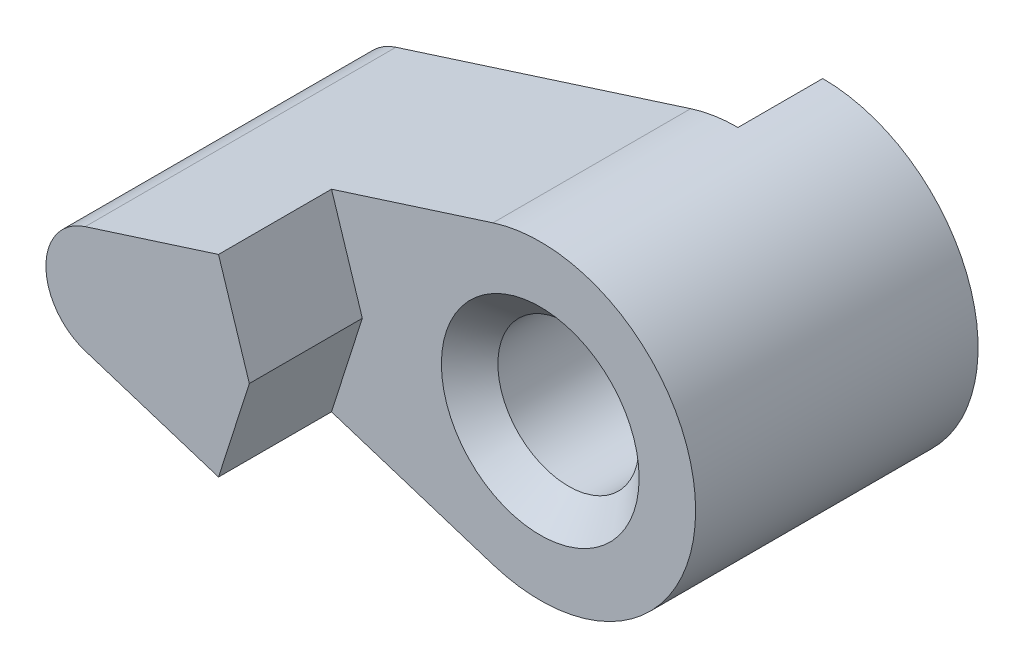
ISO-10303-21;
HEADER;
FILE_DESCRIPTION(('STEP AP214'),'2;1');
FILE_NAME('part.step','',(''),(''),'','','');
FILE_SCHEMA(('AUTOMOTIVE_DESIGN { 1 0 10303 214 1 1 1 1 }'));
ENDSEC;
DATA;
#1=APPLICATION_CONTEXT('core data for automotive mechanical design processes');
#2=APPLICATION_PROTOCOL_DEFINITION('international standard','automotive_design',2000,#1);
#3=PRODUCT_CONTEXT('',#1,'mechanical');
#4=PRODUCT('Part','Part','',(#3));
#5=PRODUCT_RELATED_PRODUCT_CATEGORY('part','',(#4));
#6=PRODUCT_DEFINITION_FORMATION('','',#4);
#7=PRODUCT_DEFINITION_CONTEXT('part definition',#1,'design');
#8=PRODUCT_DEFINITION('design','',#6,#7);
#9=PRODUCT_DEFINITION_SHAPE('','',#8);
#10=(LENGTH_UNIT() NAMED_UNIT(*) SI_UNIT(.MILLI.,.METRE.));
#11=(NAMED_UNIT(*) PLANE_ANGLE_UNIT() SI_UNIT($,.RADIAN.));
#12=(NAMED_UNIT(*) SI_UNIT($,.STERADIAN.) SOLID_ANGLE_UNIT());
#13=UNCERTAINTY_MEASURE_WITH_UNIT(LENGTH_MEASURE(1.E-05),#10,'distance_accuracy_value','');
#14=(GEOMETRIC_REPRESENTATION_CONTEXT(3) GLOBAL_UNCERTAINTY_ASSIGNED_CONTEXT((#13)) GLOBAL_UNIT_ASSIGNED_CONTEXT((#10,
#11,#12)) REPRESENTATION_CONTEXT('',''));
#15=CARTESIAN_POINT('',(0.,0.,0.));
#16=DIRECTION('',(0.,0.,1.));
#17=DIRECTION('',(1.,0.,0.));
#18=AXIS2_PLACEMENT_3D('',#15,#16,#17);
#19=CARTESIAN_POINT('',(-1.67391304347826,5.23908533265811,14.));
#20=DIRECTION('',(0.304347826086956,-0.952560969574202,0.));
#21=DIRECTION('',(0.952560969574202,0.304347826086957,0.));
#22=AXIS2_PLACEMENT_3D('',#19,#20,#21);
#23=PLANE('',#22);
#24=DIRECTION('',(-0.952560969574202,-0.304347826086957,0.));
#25=VECTOR('',#24,1.);
#26=CARTESIAN_POINT('',(-20.9265529123236,-0.912226003494337,3.));
#27=LINE('',#26,#25);
#28=CARTESIAN_POINT('',(-1.67391304347826,5.23908533265811,3.));
#29=VERTEX_POINT('',#28);
#30=CARTESIAN_POINT('',(-12.1086956521739,1.9051219391484,3.));
#31=VERTEX_POINT('',#30);
#32=EDGE_CURVE('E130',#29,#31,#27,.T.);
#33=ORIENTED_EDGE('',*,*,#32,.T.);
#34=DIRECTION('',(0.,0.,-1.));
#35=VECTOR('',#34,1.);
#36=CARTESIAN_POINT('',(-12.1086956521739,1.9051219391484,14.));
#37=LINE('',#36,#35);
#38=CARTESIAN_POINT('',(-12.1086956521739,1.9051219391484,14.));
#39=VERTEX_POINT('',#38);
#40=EDGE_CURVE('E198',#39,#31,#37,.T.);
#41=ORIENTED_EDGE('',*,*,#40,.F.);
#42=DIRECTION('',(-0.952560969574202,-0.304347826086957,0.));
#43=VECTOR('',#42,1.);
#44=CARTESIAN_POINT('',(-1.67391304347826,5.23908533265811,14.));
#45=LINE('',#44,#43);
#46=CARTESIAN_POINT('',(-7.38927886092347,3.41299837613637,14.));
#47=VERTEX_POINT('',#46);
#48=EDGE_CURVE('E184',#47,#39,#45,.T.);
#49=ORIENTED_EDGE('',*,*,#48,.F.);
#50=DIRECTION('',(0.,0.,1.));
#51=VECTOR('',#50,1.);
#52=CARTESIAN_POINT('',(-7.38927886092347,3.41299837613637,10.));
#53=LINE('',#52,#51);
#54=CARTESIAN_POINT('',(-7.38927886092347,3.41299837613637,10.));
#55=VERTEX_POINT('',#54);
#56=EDGE_CURVE('E169',#55,#47,#53,.T.);
#57=ORIENTED_EDGE('',*,*,#56,.F.);
#58=DIRECTION('',(-0.952560969574202,-0.304347826086957,0.));
#59=VECTOR('',#58,1.);
#60=CARTESIAN_POINT('',(-1.67391304347826,5.23908533265811,10.));
#61=LINE('',#60,#59);
#62=CARTESIAN_POINT('',(-1.67391304347826,5.23908533265811,10.));
#63=VERTEX_POINT('',#62);
#64=EDGE_CURVE('E160',#63,#55,#61,.T.);
#65=ORIENTED_EDGE('',*,*,#64,.F.);
#66=DIRECTION('',(0.,0.,-1.));
#67=VECTOR('',#66,1.);
#68=CARTESIAN_POINT('',(-1.67391304347826,5.23908533265811,14.));
#69=LINE('',#68,#67);
#70=EDGE_CURVE('E201',#63,#29,#69,.T.);
#71=ORIENTED_EDGE('',*,*,#70,.T.);
#72=EDGE_LOOP('',(#33,#41,#49,#57,#65,#71));
#73=FACE_BOUND('',#72,.T.);
#74=ADVANCED_FACE('F39',(#73),#23,.F.);
#75=CARTESIAN_POINT('',(-11.5,0.,14.));
#76=DIRECTION('',(0.,0.,-1.));
#77=DIRECTION('',(-1.,0.,0.));
#78=AXIS2_PLACEMENT_3D('',#75,#76,#77);
#79=CYLINDRICAL_SURFACE('',#78,2.);
#80=CARTESIAN_POINT('',(-11.5,0.,3.));
#81=DIRECTION('',(0.,0.,-1.));
#82=DIRECTION('',(-1.,0.,0.));
#83=AXIS2_PLACEMENT_3D('',#80,#81,#82);
#84=CIRCLE('',#83,2.);
#85=CARTESIAN_POINT('',(-12.1086956521739,-1.9051219391484,3.));
#86=VERTEX_POINT('',#85);
#87=EDGE_CURVE('E154',#31,#86,#84,.F.);
#88=ORIENTED_EDGE('',*,*,#87,.T.);
#89=DIRECTION('',(0.,0.,-1.));
#90=VECTOR('',#89,1.);
#91=CARTESIAN_POINT('',(-12.1086956521739,-1.9051219391484,14.));
#92=LINE('',#91,#90);
#93=CARTESIAN_POINT('',(-12.1086956521739,-1.9051219391484,14.));
#94=VERTEX_POINT('',#93);
#95=EDGE_CURVE('E195',#94,#86,#92,.T.);
#96=ORIENTED_EDGE('',*,*,#95,.F.);
#97=CARTESIAN_POINT('',(-11.5,0.,14.));
#98=DIRECTION('',(0.,0.,1.));
#99=DIRECTION('',(1.,0.,0.));
#100=AXIS2_PLACEMENT_3D('',#97,#98,#99);
#101=CIRCLE('',#100,2.);
#102=EDGE_CURVE('E186',#39,#94,#101,.T.);
#103=ORIENTED_EDGE('',*,*,#102,.F.);
#104=ORIENTED_EDGE('',*,*,#40,.T.);
#105=EDGE_LOOP('',(#88,#96,#103,#104));
#106=FACE_BOUND('',#105,.T.);
#107=ADVANCED_FACE('F216',(#106),#79,.T.);
#108=CARTESIAN_POINT('',(-12.1086956521739,-1.9051219391484,14.));
#109=DIRECTION('',(0.304347826086956,0.952560969574202,0.));
#110=DIRECTION('',(-0.952560969574202,0.304347826086956,0.));
#111=AXIS2_PLACEMENT_3D('',#108,#109,#110);
#112=PLANE('',#111);
#113=DIRECTION('',(0.952560969574202,-0.304347826086956,0.));
#114=VECTOR('',#113,1.);
#115=CARTESIAN_POINT('',(-20.9265529123236,0.912226003494337,3.));
#116=LINE('',#115,#114);
#117=CARTESIAN_POINT('',(-1.67391304347826,-5.23908533265811,3.));
#118=VERTEX_POINT('',#117);
#119=EDGE_CURVE('E271',#86,#118,#116,.T.);
#120=ORIENTED_EDGE('',*,*,#119,.T.);
#121=DIRECTION('',(0.,0.,-1.));
#122=VECTOR('',#121,1.);
#123=CARTESIAN_POINT('',(-1.67391304347826,-5.23908533265811,14.));
#124=LINE('',#123,#122);
#125=CARTESIAN_POINT('',(-1.67391304347826,-5.23908533265811,10.));
#126=VERTEX_POINT('',#125);
#127=EDGE_CURVE('E191',#126,#118,#124,.T.);
#128=ORIENTED_EDGE('',*,*,#127,.F.);
#129=DIRECTION('',(0.952560969574202,-0.304347826086957,0.));
#130=VECTOR('',#129,1.);
#131=CARTESIAN_POINT('',(-1.67391304347826,-5.23908533265811,10.));
#132=LINE('',#131,#130);
#133=CARTESIAN_POINT('',(-7.38927886092347,-3.41299837613637,10.));
#134=VERTEX_POINT('',#133);
#135=EDGE_CURVE('E167',#134,#126,#132,.T.);
#136=ORIENTED_EDGE('',*,*,#135,.F.);
#137=DIRECTION('',(0.,0.,1.));
#138=VECTOR('',#137,1.);
#139=CARTESIAN_POINT('',(-7.38927886092347,-3.41299837613637,10.));
#140=LINE('',#139,#138);
#141=CARTESIAN_POINT('',(-7.38927886092347,-3.41299837613637,14.));
#142=VERTEX_POINT('',#141);
#143=EDGE_CURVE('E175',#134,#142,#140,.T.);
#144=ORIENTED_EDGE('',*,*,#143,.T.);
#145=DIRECTION('',(0.952560969574202,-0.304347826086956,0.));
#146=VECTOR('',#145,1.);
#147=CARTESIAN_POINT('',(-12.1086956521739,-1.9051219391484,14.));
#148=LINE('',#147,#146);
#149=EDGE_CURVE('E188',#94,#142,#148,.T.);
#150=ORIENTED_EDGE('',*,*,#149,.F.);
#151=ORIENTED_EDGE('',*,*,#95,.T.);
#152=EDGE_LOOP('',(#120,#128,#136,#144,#150,#151));
#153=FACE_BOUND('',#152,.T.);
#154=ADVANCED_FACE('F222',(#153),#112,.F.);
#155=CARTESIAN_POINT('',(0.,0.,14.));
#156=DIRECTION('',(0.,0.,-1.));
#157=DIRECTION('',(-1.,0.,0.));
#158=AXIS2_PLACEMENT_3D('',#155,#156,#157);
#159=CYLINDRICAL_SURFACE('',#158,5.5);
#160=CARTESIAN_POINT('',(0.,0.,0.));
#161=DIRECTION('',(0.,0.,1.));
#162=DIRECTION('',(1.,0.,0.));
#163=AXIS2_PLACEMENT_3D('',#160,#161,#162);
#164=CIRCLE('',#163,5.5);
#165=CARTESIAN_POINT('',(1.88111078829118,-5.16830941432249,0.));
#166=VERTEX_POINT('',#165);
#167=CARTESIAN_POINT('',(0.,5.5,0.));
#168=VERTEX_POINT('',#167);
#169=EDGE_CURVE('E150',#166,#168,#164,.T.);
#170=ORIENTED_EDGE('',*,*,#169,.T.);
#171=DIRECTION('',(0.,0.,-1.));
#172=VECTOR('',#171,1.);
#173=CARTESIAN_POINT('',(0.,5.5,3.));
#174=LINE('',#173,#172);
#175=CARTESIAN_POINT('',(0.,5.5,3.));
#176=VERTEX_POINT('',#175);
#177=EDGE_CURVE('E139',#176,#168,#174,.T.);
#178=ORIENTED_EDGE('',*,*,#177,.F.);
#179=CARTESIAN_POINT('',(0.,0.,3.));
#180=DIRECTION('',(0.,0.,-1.));
#181=DIRECTION('',(-1.,0.,0.));
#182=AXIS2_PLACEMENT_3D('',#179,#180,#181);
#183=CIRCLE('',#182,5.5);
#184=EDGE_CURVE('E123',#176,#29,#183,.F.);
#185=ORIENTED_EDGE('',*,*,#184,.T.);
#186=ORIENTED_EDGE('',*,*,#70,.F.);
#187=CARTESIAN_POINT('',(0.,0.,10.));
#188=DIRECTION('',(0.,0.,1.));
#189=DIRECTION('',(1.,0.,0.));
#190=AXIS2_PLACEMENT_3D('',#187,#188,#189);
#191=CIRCLE('',#190,5.5);
#192=EDGE_CURVE('E158',#126,#63,#191,.T.);
#193=ORIENTED_EDGE('',*,*,#192,.F.);
#194=ORIENTED_EDGE('',*,*,#127,.T.);
#195=CARTESIAN_POINT('',(1.88111078829118,-5.16830941432249,3.));
#196=VERTEX_POINT('',#195);
#197=EDGE_CURVE('E54',#118,#196,#183,.F.);
#198=ORIENTED_EDGE('',*,*,#197,.T.);
#199=DIRECTION('',(0.,0.,-1.));
#200=VECTOR('',#199,1.);
#201=CARTESIAN_POINT('',(1.88111078829118,-5.16830941432249,3.));
#202=LINE('',#201,#200);
#203=EDGE_CURVE('E173',#196,#166,#202,.T.);
#204=ORIENTED_EDGE('',*,*,#203,.T.);
#205=EDGE_LOOP('',(#170,#178,#185,#186,#193,#194,#198,#204));
#206=FACE_BOUND('',#205,.T.);
#207=ADVANCED_FACE('F147',(#206),#159,.T.);
#208=CARTESIAN_POINT('',(0.,0.,14.));
#209=DIRECTION('',(0.,0.,-1.));
#210=DIRECTION('',(-1.,0.,0.));
#211=AXIS2_PLACEMENT_3D('',#208,#209,#210);
#212=CYLINDRICAL_SURFACE('',#211,2.5);
#213=CARTESIAN_POINT('',(0.,0.,9.));
#214=DIRECTION('',(0.,0.,1.));
#215=DIRECTION('',(1.,0.,0.));
#216=AXIS2_PLACEMENT_3D('',#213,#214,#215);
#217=CIRCLE('',#216,2.5);
#218=CARTESIAN_POINT('',(2.5,0.,9.));
#219=VERTEX_POINT('',#218);
#220=EDGE_CURVE('E47',#219,#219,#217,.T.);
#221=ORIENTED_EDGE('',*,*,#220,.T.);
#222=EDGE_LOOP('',(#221));
#223=FACE_BOUND('',#222,.T.);
#224=DIRECTION('',(0.,0.,-1.));
#225=VECTOR('',#224,1.);
#226=CARTESIAN_POINT('',(1.34174848841226,-2.10943380883199,3.));
#227=LINE('',#226,#225);
#228=CARTESIAN_POINT('',(1.34174848841226,-2.10943380883199,3.));
#229=VERTEX_POINT('',#228);
#230=CARTESIAN_POINT('',(1.34174848841226,-2.10943380883199,0.));
#231=VERTEX_POINT('',#230);
#232=EDGE_CURVE('E152',#229,#231,#227,.T.);
#233=ORIENTED_EDGE('',*,*,#232,.F.);
#234=CARTESIAN_POINT('',(0.,0.,3.));
#235=DIRECTION('',(0.,0.,-1.));
#236=DIRECTION('',(-1.,0.,0.));
#237=AXIS2_PLACEMENT_3D('',#234,#235,#236);
#238=CIRCLE('',#237,2.5);
#239=CARTESIAN_POINT('',(0.539362299878918,2.44112439450949,3.));
#240=VERTEX_POINT('',#239);
#241=EDGE_CURVE('E143',#240,#229,#238,.F.);
#242=ORIENTED_EDGE('',*,*,#241,.F.);
#243=DIRECTION('',(0.,0.,-1.));
#244=VECTOR('',#243,1.);
#245=CARTESIAN_POINT('',(0.539362299878918,2.44112439450949,3.));
#246=LINE('',#245,#244);
#247=CARTESIAN_POINT('',(0.539362299878918,2.44112439450949,0.));
#248=VERTEX_POINT('',#247);
#249=EDGE_CURVE('E142',#240,#248,#246,.T.);
#250=ORIENTED_EDGE('',*,*,#249,.T.);
#251=CARTESIAN_POINT('',(0.,0.,0.));
#252=DIRECTION('',(0.,0.,1.));
#253=DIRECTION('',(1.,0.,0.));
#254=AXIS2_PLACEMENT_3D('',#251,#252,#253);
#255=CIRCLE('',#254,2.5);
#256=EDGE_CURVE('E178',#231,#248,#255,.T.);
#257=ORIENTED_EDGE('',*,*,#256,.F.);
#258=EDGE_LOOP('',(#233,#242,#250,#257));
#259=FACE_BOUND('',#258,.T.);
#260=ADVANCED_FACE('F205',(#223,#259),#212,.F.);
#261=CARTESIAN_POINT('',(0.,0.,14.));
#262=DIRECTION('',(0.,0.,1.));
#263=DIRECTION('',(1.,0.,0.));
#264=AXIS2_PLACEMENT_3D('',#261,#262,#263);
#265=PLANE('',#264);
#266=DIRECTION('',(-0.304347826086957,-0.952560969574202,0.));
#267=VECTOR('',#266,1.);
#268=CARTESIAN_POINT('',(-6.29880941130941,0.,14.));
#269=LINE('',#268,#267);
#270=CARTESIAN_POINT('',(-6.29880941130941,0.,14.));
#271=VERTEX_POINT('',#270);
#272=EDGE_CURVE('E161',#271,#142,#269,.T.);
#273=ORIENTED_EDGE('',*,*,#272,.F.);
#274=DIRECTION('',(0.304347826086957,-0.952560969574202,0.));
#275=VECTOR('',#274,1.);
#276=CARTESIAN_POINT('',(-7.38927886092347,3.41299837613637,14.));
#277=LINE('',#276,#275);
#278=EDGE_CURVE('E170',#47,#271,#277,.T.);
#279=ORIENTED_EDGE('',*,*,#278,.F.);
#280=ORIENTED_EDGE('',*,*,#48,.T.);
#281=ORIENTED_EDGE('',*,*,#102,.T.);
#282=ORIENTED_EDGE('',*,*,#149,.T.);
#283=EDGE_LOOP('',(#273,#279,#280,#281,#282));
#284=FACE_BOUND('',#283,.T.);
#285=ADVANCED_FACE('F231',(#284),#265,.T.);
#286=CARTESIAN_POINT('',(0.,0.,0.));
#287=DIRECTION('',(0.,0.,1.));
#288=DIRECTION('',(1.,0.,0.));
#289=AXIS2_PLACEMENT_3D('',#286,#287,#288);
#290=PLANE('',#289);
#291=ORIENTED_EDGE('',*,*,#169,.F.);
#292=DIRECTION('',(0.173648177666931,-0.984807753012208,0.));
#293=VECTOR('',#292,1.);
#294=CARTESIAN_POINT('',(0.300754000321379,3.79433930580006,0.));
#295=LINE('',#294,#293);
#296=EDGE_CURVE('E135',#231,#166,#295,.T.);
#297=ORIENTED_EDGE('',*,*,#296,.F.);
#298=ORIENTED_EDGE('',*,*,#256,.T.);
#299=EDGE_CURVE('E265',#168,#248,#295,.T.);
#300=ORIENTED_EDGE('',*,*,#299,.F.);
#301=EDGE_LOOP('',(#291,#297,#298,#300));
#302=FACE_BOUND('',#301,.T.);
#303=ADVANCED_FACE('F237',(#302),#290,.F.);
#304=CARTESIAN_POINT('',(-6.29880941130941,0.,10.));
#305=DIRECTION('',(-0.952560969574202,0.304347826086957,0.));
#306=DIRECTION('',(-0.304347826086957,-0.952560969574202,0.));
#307=AXIS2_PLACEMENT_3D('',#304,#305,#306);
#308=PLANE('',#307);
#309=ORIENTED_EDGE('',*,*,#272,.T.);
#310=ORIENTED_EDGE('',*,*,#143,.F.);
#311=DIRECTION('',(-0.304347826086957,-0.952560969574202,0.));
#312=VECTOR('',#311,1.);
#313=CARTESIAN_POINT('',(-6.29880941130941,0.,10.));
#314=LINE('',#313,#312);
#315=CARTESIAN_POINT('',(-6.29880941130941,0.,10.));
#316=VERTEX_POINT('',#315);
#317=EDGE_CURVE('E62',#316,#134,#314,.T.);
#318=ORIENTED_EDGE('',*,*,#317,.F.);
#319=DIRECTION('',(0.,0.,1.));
#320=VECTOR('',#319,1.);
#321=CARTESIAN_POINT('',(-6.29880941130941,0.,10.));
#322=LINE('',#321,#320);
#323=EDGE_CURVE('E179',#316,#271,#322,.T.);
#324=ORIENTED_EDGE('',*,*,#323,.T.);
#325=EDGE_LOOP('',(#309,#310,#318,#324));
#326=FACE_BOUND('',#325,.T.);
#327=ADVANCED_FACE('F240',(#326),#308,.F.);
#328=CARTESIAN_POINT('',(-7.38927886092347,3.41299837613637,10.));
#329=DIRECTION('',(-0.952560969574202,-0.304347826086957,0.));
#330=DIRECTION('',(0.304347826086957,-0.952560969574202,0.));
#331=AXIS2_PLACEMENT_3D('',#328,#329,#330);
#332=PLANE('',#331);
#333=ORIENTED_EDGE('',*,*,#278,.T.);
#334=ORIENTED_EDGE('',*,*,#323,.F.);
#335=DIRECTION('',(0.304347826086957,-0.952560969574202,0.));
#336=VECTOR('',#335,1.);
#337=CARTESIAN_POINT('',(-7.38927886092347,3.41299837613637,10.));
#338=LINE('',#337,#336);
#339=EDGE_CURVE('E164',#55,#316,#338,.T.);
#340=ORIENTED_EDGE('',*,*,#339,.F.);
#341=ORIENTED_EDGE('',*,*,#56,.T.);
#342=EDGE_LOOP('',(#333,#334,#340,#341));
#343=FACE_BOUND('',#342,.T.);
#344=ADVANCED_FACE('F245',(#343),#332,.F.);
#345=CARTESIAN_POINT('',(0.,0.,10.));
#346=DIRECTION('',(0.,0.,1.));
#347=DIRECTION('',(1.,0.,0.));
#348=AXIS2_PLACEMENT_3D('',#345,#346,#347);
#349=PLANE('',#348);
#350=CARTESIAN_POINT('',(0.,0.,10.));
#351=DIRECTION('',(0.,0.,1.));
#352=DIRECTION('',(1.,0.,0.));
#353=AXIS2_PLACEMENT_3D('',#350,#351,#352);
#354=CIRCLE('',#353,3.50000000000001);
#355=CARTESIAN_POINT('',(3.50000000000001,0.,10.));
#356=VERTEX_POINT('',#355);
#357=EDGE_CURVE('E11',#356,#356,#354,.F.);
#358=ORIENTED_EDGE('',*,*,#357,.T.);
#359=EDGE_LOOP('',(#358));
#360=FACE_BOUND('',#359,.T.);
#361=ORIENTED_EDGE('',*,*,#192,.T.);
#362=ORIENTED_EDGE('',*,*,#64,.T.);
#363=ORIENTED_EDGE('',*,*,#339,.T.);
#364=ORIENTED_EDGE('',*,*,#317,.T.);
#365=ORIENTED_EDGE('',*,*,#135,.T.);
#366=EDGE_LOOP('',(#361,#362,#363,#364,#365));
#367=FACE_BOUND('',#366,.T.);
#368=ADVANCED_FACE('F248',(#360,#367),#349,.T.);
#369=CARTESIAN_POINT('',(0.300754000321379,3.79433930580006,3.));
#370=DIRECTION('',(0.984807753012208,0.173648177666931,0.));
#371=DIRECTION('',(-0.173648177666931,0.984807753012208,0.));
#372=AXIS2_PLACEMENT_3D('',#369,#370,#371);
#373=PLANE('',#372);
#374=ORIENTED_EDGE('',*,*,#296,.T.);
#375=ORIENTED_EDGE('',*,*,#203,.F.);
#376=DIRECTION('',(0.173648177666931,-0.984807753012208,0.));
#377=VECTOR('',#376,1.);
#378=CARTESIAN_POINT('',(0.300754000321379,3.79433930580006,3.));
#379=LINE('',#378,#377);
#380=EDGE_CURVE('E145',#229,#196,#379,.T.);
#381=ORIENTED_EDGE('',*,*,#380,.F.);
#382=ORIENTED_EDGE('',*,*,#232,.T.);
#383=EDGE_LOOP('',(#374,#375,#381,#382));
#384=FACE_BOUND('',#383,.T.);
#385=ADVANCED_FACE('F255',(#384),#373,.F.);
#386=ORIENTED_EDGE('',*,*,#299,.T.);
#387=ORIENTED_EDGE('',*,*,#249,.F.);
#388=EDGE_CURVE('E127',#176,#240,#379,.T.);
#389=ORIENTED_EDGE('',*,*,#388,.F.);
#390=ORIENTED_EDGE('',*,*,#177,.T.);
#391=EDGE_LOOP('',(#386,#387,#389,#390));
#392=FACE_BOUND('',#391,.T.);
#393=ADVANCED_FACE('F138',(#392),#373,.F.);
#394=CARTESIAN_POINT('',(-21.2180135221233,0.,3.));
#395=DIRECTION('',(0.,0.,-1.));
#396=DIRECTION('',(-1.,0.,0.));
#397=AXIS2_PLACEMENT_3D('',#394,#395,#396);
#398=PLANE('',#397);
#399=ORIENTED_EDGE('',*,*,#184,.F.);
#400=ORIENTED_EDGE('',*,*,#388,.T.);
#401=ORIENTED_EDGE('',*,*,#241,.T.);
#402=ORIENTED_EDGE('',*,*,#380,.T.);
#403=ORIENTED_EDGE('',*,*,#197,.F.);
#404=ORIENTED_EDGE('',*,*,#119,.F.);
#405=ORIENTED_EDGE('',*,*,#87,.F.);
#406=ORIENTED_EDGE('',*,*,#32,.F.);
#407=EDGE_LOOP('',(#399,#400,#401,#402,#403,#404,#405,#406));
#408=FACE_BOUND('',#407,.T.);
#409=ADVANCED_FACE('F125',(#408),#398,.T.);
#410=CARTESIAN_POINT('',(0.,0.,9.));
#411=DIRECTION('',(0.,0.,1.));
#412=DIRECTION('',(1.,0.,0.));
#413=AXIS2_PLACEMENT_3D('',#410,#411,#412);
#414=CONICAL_SURFACE('',#413,2.5,0.785398163397451);
#415=ORIENTED_EDGE('',*,*,#357,.F.);
#416=EDGE_LOOP('',(#415));
#417=FACE_BOUND('',#416,.T.);
#418=ORIENTED_EDGE('',*,*,#220,.F.);
#419=EDGE_LOOP('',(#418));
#420=FACE_BOUND('',#419,.T.);
#421=ADVANCED_FACE('F41',(#417,#420),#414,.F.);
#422=CLOSED_SHELL('',(#74,#107,#154,#207,#260,#285,#303,#327,#344,#368,#385,#393,#409,#421));
#423=MANIFOLD_SOLID_BREP('B2',#422);
#424=ADVANCED_BREP_SHAPE_REPRESENTATION('',(#18,#423),#14);
#425=SHAPE_DEFINITION_REPRESENTATION(#9,#424);
ENDSEC;
END-ISO-10303-21;
